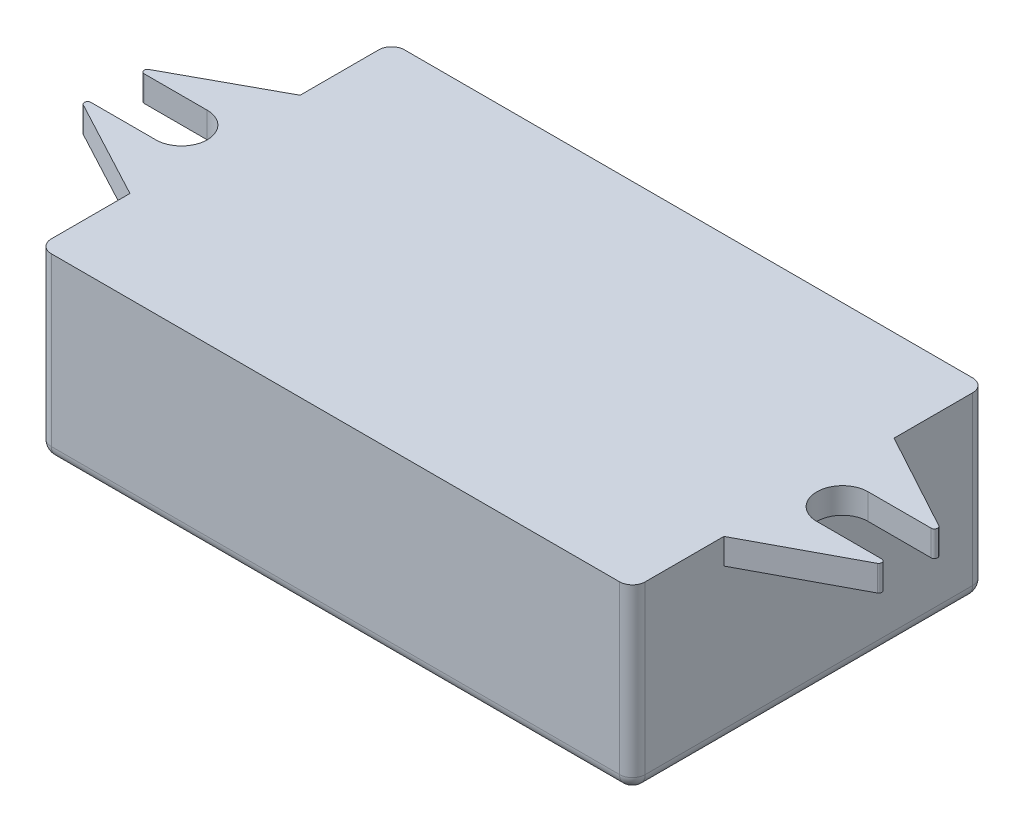
ISO-10303-21;
HEADER;
FILE_DESCRIPTION(('STEP AP214'),'2;1');
FILE_NAME('part.step','',(''),(''),'','','');
FILE_SCHEMA(('AUTOMOTIVE_DESIGN { 1 0 10303 214 1 1 1 1 }'));
ENDSEC;
DATA;
#1=APPLICATION_CONTEXT('core data for automotive mechanical design processes');
#2=APPLICATION_PROTOCOL_DEFINITION('international standard','automotive_design',2000,#1);
#3=PRODUCT_CONTEXT('',#1,'mechanical');
#4=PRODUCT('Part','Part','',(#3));
#5=PRODUCT_RELATED_PRODUCT_CATEGORY('part','',(#4));
#6=PRODUCT_DEFINITION_FORMATION('','',#4);
#7=PRODUCT_DEFINITION_CONTEXT('part definition',#1,'design');
#8=PRODUCT_DEFINITION('design','',#6,#7);
#9=PRODUCT_DEFINITION_SHAPE('','',#8);
#10=(LENGTH_UNIT() NAMED_UNIT(*) SI_UNIT(.MILLI.,.METRE.));
#11=(NAMED_UNIT(*) PLANE_ANGLE_UNIT() SI_UNIT($,.RADIAN.));
#12=(NAMED_UNIT(*) SI_UNIT($,.STERADIAN.) SOLID_ANGLE_UNIT());
#13=UNCERTAINTY_MEASURE_WITH_UNIT(LENGTH_MEASURE(1.E-05),#10,'distance_accuracy_value','');
#14=(GEOMETRIC_REPRESENTATION_CONTEXT(3) GLOBAL_UNCERTAINTY_ASSIGNED_CONTEXT((#13)) GLOBAL_UNIT_ASSIGNED_CONTEXT((#10,
#11,#12)) REPRESENTATION_CONTEXT('',''));
#15=CARTESIAN_POINT('',(0.,0.,0.));
#16=DIRECTION('',(0.,0.,1.));
#17=DIRECTION('',(1.,0.,0.));
#18=AXIS2_PLACEMENT_3D('',#15,#16,#17);
#19=CARTESIAN_POINT('',(35.6115448182948,0.,0.729525455250196));
#20=DIRECTION('',(0.,1.,0.));
#21=DIRECTION('',(0.,0.,1.));
#22=AXIS2_PLACEMENT_3D('',#19,#20,#21);
#23=PLANE('',#22);
#24=DIRECTION('',(1.,0.,0.));
#25=VECTOR('',#24,1.);
#26=CARTESIAN_POINT('',(-21.7468585785958,0.,-1.27047454474981));
#27=LINE('',#26,#25);
#28=CARTESIAN_POINT('',(-20.7643283831103,0.,-1.27047454474981));
#29=VERTEX_POINT('',#28);
#30=CARTESIAN_POINT('',(-15.8552619754863,0.,-1.27047454474981));
#31=VERTEX_POINT('',#30);
#32=EDGE_CURVE('E288',#29,#31,#27,.T.);
#33=ORIENTED_EDGE('',*,*,#32,.F.);
#34=CARTESIAN_POINT('',(-20.7643283831103,0.,-1.52047454474981));
#35=DIRECTION('',(0.,1.,0.));
#36=DIRECTION('',(0.,0.,1.));
#37=AXIS2_PLACEMENT_3D('',#34,#35,#36);
#38=CIRCLE('',#37,0.25);
#39=CARTESIAN_POINT('',(-20.8838150905389,0.,-1.74007173678075));
#40=VERTEX_POINT('',#39);
#41=EDGE_CURVE('E51',#29,#40,#38,.F.);
#42=ORIENTED_EDGE('',*,*,#41,.T.);
#43=DIRECTION('',(-0.878388768123751,0.,0.477946829714394));
#44=VECTOR('',#43,1.);
#45=CARTESIAN_POINT('',(-13.2468585785958,0.,-5.89547454474981));
#46=LINE('',#45,#44);
#47=CARTESIAN_POINT('',(-13.2468585785958,0.,-5.89547454474981));
#48=VERTEX_POINT('',#47);
#49=EDGE_CURVE('E290',#48,#40,#46,.T.);
#50=ORIENTED_EDGE('',*,*,#49,.F.);
#51=DIRECTION('',(0.,0.,-1.));
#52=VECTOR('',#51,1.);
#53=CARTESIAN_POINT('',(-13.2468585785958,0.,14.4795254552502));
#54=LINE('',#53,#52);
#55=CARTESIAN_POINT('',(-13.2468585785958,0.,7.3545254552502));
#56=VERTEX_POINT('',#55);
#57=EDGE_CURVE('E316',#56,#48,#54,.T.);
#58=ORIENTED_EDGE('',*,*,#57,.F.);
#59=DIRECTION('',(0.882297478750126,0.,0.470692212588195));
#60=VECTOR('',#59,1.);
#61=CARTESIAN_POINT('',(-21.9162729646575,0.,2.72952545525019));
#62=LINE('',#61,#60);
#63=CARTESIAN_POINT('',(-21.0341963786508,0.,3.20009982493772));
#64=VERTEX_POINT('',#63);
#65=EDGE_CURVE('E282',#64,#56,#62,.T.);
#66=ORIENTED_EDGE('',*,*,#65,.F.);
#67=CARTESIAN_POINT('',(-20.9165233255038,0.,2.97952545525019));
#68=DIRECTION('',(0.,1.,0.));
#69=DIRECTION('',(0.,0.,1.));
#70=AXIS2_PLACEMENT_3D('',#67,#68,#69);
#71=CIRCLE('',#70,0.25);
#72=CARTESIAN_POINT('',(-20.9165233255038,0.,2.72952545525019));
#73=VERTEX_POINT('',#72);
#74=EDGE_CURVE('E58',#64,#73,#71,.F.);
#75=ORIENTED_EDGE('',*,*,#74,.T.);
#76=DIRECTION('',(-1.,0.,0.));
#77=VECTOR('',#76,1.);
#78=CARTESIAN_POINT('',(-15.8552619754863,0.,2.7295254552502));
#79=LINE('',#78,#77);
#80=CARTESIAN_POINT('',(-15.8552619754863,0.,2.7295254552502));
#81=VERTEX_POINT('',#80);
#82=EDGE_CURVE('E284',#81,#73,#79,.T.);
#83=ORIENTED_EDGE('',*,*,#82,.F.);
#84=CARTESIAN_POINT('',(-15.8552619754863,0.,0.729525455250193));
#85=DIRECTION('',(0.,-1.,0.));
#86=DIRECTION('',(0.,0.,-1.));
#87=AXIS2_PLACEMENT_3D('',#84,#85,#86);
#88=CIRCLE('',#87,2.);
#89=EDGE_CURVE('E286',#31,#81,#88,.T.);
#90=ORIENTED_EDGE('',*,*,#89,.F.);
#91=EDGE_LOOP('',(#33,#42,#50,#58,#66,#75,#83,#90));
#92=FACE_BOUND('',#91,.T.);
#93=ADVANCED_FACE('F36',(#92),#23,.F.);
#94=DIRECTION('',(0.878388768123751,0.,0.477946829714394));
#95=VECTOR('',#94,1.);
#96=CARTESIAN_POINT('',(33.0031414214042,0.,-5.8954745447498));
#97=LINE('',#96,#95);
#98=CARTESIAN_POINT('',(33.0031414214042,0.,-5.8954745447498));
#99=VERTEX_POINT('',#98);
#100=CARTESIAN_POINT('',(40.6400979333473,0.,-1.74007173678074));
#101=VERTEX_POINT('',#100);
#102=EDGE_CURVE('E230',#99,#101,#97,.T.);
#103=ORIENTED_EDGE('',*,*,#102,.T.);
#104=CARTESIAN_POINT('',(40.5206112259188,0.,-1.5204745447498));
#105=DIRECTION('',(0.,1.,0.));
#106=DIRECTION('',(0.,0.,1.));
#107=AXIS2_PLACEMENT_3D('',#104,#105,#106);
#108=CIRCLE('',#107,0.25);
#109=CARTESIAN_POINT('',(40.5206112259188,0.,-1.2704745447498));
#110=VERTEX_POINT('',#109);
#111=EDGE_CURVE('E391',#101,#110,#108,.F.);
#112=ORIENTED_EDGE('',*,*,#111,.T.);
#113=DIRECTION('',(-1.,0.,0.));
#114=VECTOR('',#113,1.);
#115=CARTESIAN_POINT('',(41.5031414214042,0.,-1.2704745447498));
#116=LINE('',#115,#114);
#117=CARTESIAN_POINT('',(35.6115448182948,0.,-1.2704745447498));
#118=VERTEX_POINT('',#117);
#119=EDGE_CURVE('E271',#110,#118,#116,.T.);
#120=ORIENTED_EDGE('',*,*,#119,.T.);
#121=CARTESIAN_POINT('',(35.6115448182948,0.,0.729525455250196));
#122=DIRECTION('',(0.,1.,0.));
#123=DIRECTION('',(0.,0.,1.));
#124=AXIS2_PLACEMENT_3D('',#121,#122,#123);
#125=CIRCLE('',#124,2.);
#126=CARTESIAN_POINT('',(35.6115448182948,0.,2.7295254552502));
#127=VERTEX_POINT('',#126);
#128=EDGE_CURVE('E274',#118,#127,#125,.T.);
#129=ORIENTED_EDGE('',*,*,#128,.T.);
#130=DIRECTION('',(1.,0.,0.));
#131=VECTOR('',#130,1.);
#132=CARTESIAN_POINT('',(35.6115448182948,0.,2.7295254552502));
#133=LINE('',#132,#131);
#134=CARTESIAN_POINT('',(40.6728061683122,0.,2.7295254552502));
#135=VERTEX_POINT('',#134);
#136=EDGE_CURVE('E277',#127,#135,#133,.T.);
#137=ORIENTED_EDGE('',*,*,#136,.T.);
#138=CARTESIAN_POINT('',(40.6728061683122,0.,2.9795254552502));
#139=DIRECTION('',(0.,1.,0.));
#140=DIRECTION('',(0.,0.,1.));
#141=AXIS2_PLACEMENT_3D('',#138,#139,#140);
#142=CIRCLE('',#141,0.25);
#143=CARTESIAN_POINT('',(40.7904792214593,0.,3.20009982493773));
#144=VERTEX_POINT('',#143);
#145=EDGE_CURVE('E389',#135,#144,#142,.F.);
#146=ORIENTED_EDGE('',*,*,#145,.T.);
#147=DIRECTION('',(-0.882297478750126,0.,0.470692212588194));
#148=VECTOR('',#147,1.);
#149=CARTESIAN_POINT('',(41.672555807466,0.,2.7295254552502));
#150=LINE('',#149,#148);
#151=CARTESIAN_POINT('',(33.0031414214042,0.,7.3545254552502));
#152=VERTEX_POINT('',#151);
#153=EDGE_CURVE('E280',#144,#152,#150,.T.);
#154=ORIENTED_EDGE('',*,*,#153,.T.);
#155=DIRECTION('',(0.,0.,1.));
#156=VECTOR('',#155,1.);
#157=CARTESIAN_POINT('',(33.0031414214042,0.,14.4795254552502));
#158=LINE('',#157,#156);
#159=EDGE_CURVE('E295',#99,#152,#158,.T.);
#160=ORIENTED_EDGE('',*,*,#159,.F.);
#161=EDGE_LOOP('',(#103,#112,#120,#129,#137,#146,#154,#160));
#162=FACE_BOUND('',#161,.T.);
#163=ADVANCED_FACE('F472',(#162),#23,.F.);
#164=CARTESIAN_POINT('',(-13.2468585785958,2.,-5.89547454474981));
#165=DIRECTION('',(0.477946829714394,0.,0.878388768123751));
#166=DIRECTION('',(0.878388768123751,0.,-0.477946829714394));
#167=AXIS2_PLACEMENT_3D('',#164,#165,#166);
#168=PLANE('',#167);
#169=ORIENTED_EDGE('',*,*,#49,.T.);
#170=DIRECTION('',(0.,-1.,0.));
#171=VECTOR('',#170,1.);
#172=CARTESIAN_POINT('',(-20.8838150905389,2.,-1.74007173678075));
#173=LINE('',#172,#171);
#174=CARTESIAN_POINT('',(-20.8838150905389,2.,-1.74007173678075));
#175=VERTEX_POINT('',#174);
#176=EDGE_CURVE('E412',#40,#175,#173,.F.);
#177=ORIENTED_EDGE('',*,*,#176,.T.);
#178=DIRECTION('',(-0.878388768123751,0.,0.477946829714394));
#179=VECTOR('',#178,1.);
#180=CARTESIAN_POINT('',(-13.2468585785958,2.,-5.89547454474981));
#181=LINE('',#180,#179);
#182=CARTESIAN_POINT('',(-13.2468585785958,2.,-5.89547454474981));
#183=VERTEX_POINT('',#182);
#184=EDGE_CURVE('E232',#183,#175,#181,.T.);
#185=ORIENTED_EDGE('',*,*,#184,.F.);
#186=DIRECTION('',(0.,-1.,0.));
#187=VECTOR('',#186,1.);
#188=CARTESIAN_POINT('',(-13.2468585785958,2.,-5.89547454474981));
#189=LINE('',#188,#187);
#190=EDGE_CURVE('E293',#183,#48,#189,.T.);
#191=ORIENTED_EDGE('',*,*,#190,.T.);
#192=EDGE_LOOP('',(#169,#177,#185,#191));
#193=FACE_BOUND('',#192,.T.);
#194=ADVANCED_FACE('F546',(#193),#168,.F.);
#195=CARTESIAN_POINT('',(-21.7468585785958,2.,-1.27047454474981));
#196=DIRECTION('',(0.,0.,-1.));
#197=DIRECTION('',(-1.,0.,0.));
#198=AXIS2_PLACEMENT_3D('',#195,#196,#197);
#199=PLANE('',#198);
#200=DIRECTION('',(1.,0.,0.));
#201=VECTOR('',#200,1.);
#202=CARTESIAN_POINT('',(-21.7468585785958,2.,-1.27047454474981));
#203=LINE('',#202,#201);
#204=CARTESIAN_POINT('',(-20.7643283831103,2.,-1.27047454474981));
#205=VERTEX_POINT('',#204);
#206=CARTESIAN_POINT('',(-15.8552619754863,2.,-1.27047454474981));
#207=VERTEX_POINT('',#206);
#208=EDGE_CURVE('E266',#205,#207,#203,.T.);
#209=ORIENTED_EDGE('',*,*,#208,.F.);
#210=DIRECTION('',(0.,-1.,0.));
#211=VECTOR('',#210,1.);
#212=CARTESIAN_POINT('',(-20.7643283831103,2.,-1.27047454474981));
#213=LINE('',#212,#211);
#214=EDGE_CURVE('E407',#205,#29,#213,.T.);
#215=ORIENTED_EDGE('',*,*,#214,.T.);
#216=ORIENTED_EDGE('',*,*,#32,.T.);
#217=DIRECTION('',(0.,-1.,0.));
#218=VECTOR('',#217,1.);
#219=CARTESIAN_POINT('',(-15.8552619754863,2.,-1.27047454474981));
#220=LINE('',#219,#218);
#221=EDGE_CURVE('E296',#207,#31,#220,.T.);
#222=ORIENTED_EDGE('',*,*,#221,.F.);
#223=EDGE_LOOP('',(#209,#215,#216,#222));
#224=FACE_BOUND('',#223,.T.);
#225=ADVANCED_FACE('F526',(#224),#199,.F.);
#226=CARTESIAN_POINT('',(-15.8552619754863,2.,0.729525455250193));
#227=DIRECTION('',(0.,-1.,0.));
#228=DIRECTION('',(0.,0.,-1.));
#229=AXIS2_PLACEMENT_3D('',#226,#227,#228);
#230=CYLINDRICAL_SURFACE('',#229,2.);
#231=ORIENTED_EDGE('',*,*,#89,.T.);
#232=DIRECTION('',(0.,-1.,0.));
#233=VECTOR('',#232,1.);
#234=CARTESIAN_POINT('',(-15.8552619754863,2.,2.7295254552502));
#235=LINE('',#234,#233);
#236=CARTESIAN_POINT('',(-15.8552619754863,2.,2.7295254552502));
#237=VERTEX_POINT('',#236);
#238=EDGE_CURVE('E299',#237,#81,#235,.T.);
#239=ORIENTED_EDGE('',*,*,#238,.F.);
#240=CARTESIAN_POINT('',(-15.8552619754863,2.,0.729525455250193));
#241=DIRECTION('',(0.,-1.,0.));
#242=DIRECTION('',(0.,0.,-1.));
#243=AXIS2_PLACEMENT_3D('',#240,#241,#242);
#244=CIRCLE('',#243,2.);
#245=EDGE_CURVE('E264',#207,#237,#244,.T.);
#246=ORIENTED_EDGE('',*,*,#245,.F.);
#247=ORIENTED_EDGE('',*,*,#221,.T.);
#248=EDGE_LOOP('',(#231,#239,#246,#247));
#249=FACE_BOUND('',#248,.T.);
#250=ADVANCED_FACE('F531',(#249),#230,.F.);
#251=CARTESIAN_POINT('',(-15.8552619754863,2.,2.7295254552502));
#252=DIRECTION('',(0.,0.,1.));
#253=DIRECTION('',(1.,0.,0.));
#254=AXIS2_PLACEMENT_3D('',#251,#252,#253);
#255=PLANE('',#254);
#256=ORIENTED_EDGE('',*,*,#82,.T.);
#257=DIRECTION('',(0.,-1.,0.));
#258=VECTOR('',#257,1.);
#259=CARTESIAN_POINT('',(-20.9165233255038,2.,2.72952545525019));
#260=LINE('',#259,#258);
#261=CARTESIAN_POINT('',(-20.9165233255038,2.,2.72952545525019));
#262=VERTEX_POINT('',#261);
#263=EDGE_CURVE('E11',#73,#262,#260,.F.);
#264=ORIENTED_EDGE('',*,*,#263,.T.);
#265=DIRECTION('',(-1.,0.,0.));
#266=VECTOR('',#265,1.);
#267=CARTESIAN_POINT('',(-15.8552619754863,2.,2.7295254552502));
#268=LINE('',#267,#266);
#269=EDGE_CURVE('E261',#237,#262,#268,.T.);
#270=ORIENTED_EDGE('',*,*,#269,.F.);
#271=ORIENTED_EDGE('',*,*,#238,.T.);
#272=EDGE_LOOP('',(#256,#264,#270,#271));
#273=FACE_BOUND('',#272,.T.);
#274=ADVANCED_FACE('F535',(#273),#255,.F.);
#275=CARTESIAN_POINT('',(-21.9162729646575,2.,2.72952545525019));
#276=DIRECTION('',(0.470692212588195,0.,-0.882297478750126));
#277=DIRECTION('',(-0.882297478750126,0.,-0.470692212588195));
#278=AXIS2_PLACEMENT_3D('',#275,#276,#277);
#279=PLANE('',#278);
#280=DIRECTION('',(0.882297478750126,0.,0.470692212588195));
#281=VECTOR('',#280,1.);
#282=CARTESIAN_POINT('',(-21.9162729646575,2.,2.72952545525019));
#283=LINE('',#282,#281);
#284=CARTESIAN_POINT('',(-21.0341963786508,2.,3.20009982493772));
#285=VERTEX_POINT('',#284);
#286=CARTESIAN_POINT('',(-13.2468585785958,2.,7.3545254552502));
#287=VERTEX_POINT('',#286);
#288=EDGE_CURVE('E259',#285,#287,#283,.T.);
#289=ORIENTED_EDGE('',*,*,#288,.F.);
#290=DIRECTION('',(0.,-1.,0.));
#291=VECTOR('',#290,1.);
#292=CARTESIAN_POINT('',(-21.0341963786508,2.,3.20009982493772));
#293=LINE('',#292,#291);
#294=EDGE_CURVE('E44',#285,#64,#293,.T.);
#295=ORIENTED_EDGE('',*,*,#294,.T.);
#296=ORIENTED_EDGE('',*,*,#65,.T.);
#297=DIRECTION('',(0.,-1.,0.));
#298=VECTOR('',#297,1.);
#299=CARTESIAN_POINT('',(-13.2468585785958,2.,7.3545254552502));
#300=LINE('',#299,#298);
#301=EDGE_CURVE('E302',#287,#56,#300,.T.);
#302=ORIENTED_EDGE('',*,*,#301,.F.);
#303=EDGE_LOOP('',(#289,#295,#296,#302));
#304=FACE_BOUND('',#303,.T.);
#305=ADVANCED_FACE('F417',(#304),#279,.F.);
#306=CARTESIAN_POINT('',(-13.2468585785958,2.,14.4795254552502));
#307=DIRECTION('',(-1.,0.,0.));
#308=DIRECTION('',(0.,0.,1.));
#309=AXIS2_PLACEMENT_3D('',#306,#307,#308);
#310=PLANE('',#309);
#311=DIRECTION('',(0.,0.,-1.));
#312=VECTOR('',#311,1.);
#313=CARTESIAN_POINT('',(-13.2468585785958,-11.,14.4795254552502));
#314=LINE('',#313,#312);
#315=CARTESIAN_POINT('',(-13.2468585785958,-11.,-12.0204745447498));
#316=VERTEX_POINT('',#315);
#317=CARTESIAN_POINT('',(-13.2468585785958,-11.,13.4795254552502));
#318=VERTEX_POINT('',#317);
#319=EDGE_CURVE('E328',#316,#318,#314,.F.);
#320=ORIENTED_EDGE('',*,*,#319,.T.);
#321=DIRECTION('',(0.,-1.,0.));
#322=VECTOR('',#321,1.);
#323=CARTESIAN_POINT('',(-13.2468585785958,2.,13.4795254552502));
#324=LINE('',#323,#322);
#325=CARTESIAN_POINT('',(-13.2468585785958,2.,13.4795254552502));
#326=VERTEX_POINT('',#325);
#327=EDGE_CURVE('E332',#318,#326,#324,.F.);
#328=ORIENTED_EDGE('',*,*,#327,.T.);
#329=DIRECTION('',(0.,0.,-1.));
#330=VECTOR('',#329,1.);
#331=CARTESIAN_POINT('',(-13.2468585785958,2.,14.4795254552502));
#332=LINE('',#331,#330);
#333=EDGE_CURVE('E256',#326,#287,#332,.T.);
#334=ORIENTED_EDGE('',*,*,#333,.T.);
#335=ORIENTED_EDGE('',*,*,#301,.T.);
#336=ORIENTED_EDGE('',*,*,#57,.T.);
#337=ORIENTED_EDGE('',*,*,#190,.F.);
#338=DIRECTION('',(0.,0.,-1.));
#339=VECTOR('',#338,1.);
#340=CARTESIAN_POINT('',(-13.2468585785958,2.,-5.89547454474981));
#341=LINE('',#340,#339);
#342=CARTESIAN_POINT('',(-13.2468585785958,2.,-12.0204745447498));
#343=VERTEX_POINT('',#342);
#344=EDGE_CURVE('E292',#183,#343,#341,.T.);
#345=ORIENTED_EDGE('',*,*,#344,.T.);
#346=DIRECTION('',(0.,-1.,0.));
#347=VECTOR('',#346,1.);
#348=CARTESIAN_POINT('',(-13.2468585785958,2.,-12.0204745447498));
#349=LINE('',#348,#347);
#350=EDGE_CURVE('E330',#343,#316,#349,.T.);
#351=ORIENTED_EDGE('',*,*,#350,.T.);
#352=EDGE_LOOP('',(#320,#328,#334,#335,#336,#337,#345,#351));
#353=FACE_BOUND('',#352,.T.);
#354=ADVANCED_FACE('F425',(#353),#310,.T.);
#355=CARTESIAN_POINT('',(-13.2468585785958,2.,14.4795254552502));
#356=DIRECTION('',(0.,0.,-1.));
#357=DIRECTION('',(-1.,0.,0.));
#358=AXIS2_PLACEMENT_3D('',#355,#356,#357);
#359=PLANE('',#358);
#360=DIRECTION('',(1.,0.,0.));
#361=VECTOR('',#360,1.);
#362=CARTESIAN_POINT('',(-13.2468585785958,2.,14.4795254552502));
#363=LINE('',#362,#361);
#364=CARTESIAN_POINT('',(-12.2468585785958,2.,14.4795254552502));
#365=VERTEX_POINT('',#364);
#366=CARTESIAN_POINT('',(32.0031414214042,2.,14.4795254552502));
#367=VERTEX_POINT('',#366);
#368=EDGE_CURVE('E253',#365,#367,#363,.T.);
#369=ORIENTED_EDGE('',*,*,#368,.F.);
#370=DIRECTION('',(0.,-1.,0.));
#371=VECTOR('',#370,1.);
#372=CARTESIAN_POINT('',(-12.2468585785958,-11.,14.4795254552502));
#373=LINE('',#372,#371);
#374=CARTESIAN_POINT('',(-12.2468585785958,-11.,14.4795254552502));
#375=VERTEX_POINT('',#374);
#376=EDGE_CURVE('E326',#365,#375,#373,.T.);
#377=ORIENTED_EDGE('',*,*,#376,.T.);
#378=DIRECTION('',(-1.,0.,0.));
#379=VECTOR('',#378,1.);
#380=CARTESIAN_POINT('',(33.0031414214042,-11.,14.4795254552502));
#381=LINE('',#380,#379);
#382=CARTESIAN_POINT('',(32.0031414214042,-11.,14.4795254552502));
#383=VERTEX_POINT('',#382);
#384=EDGE_CURVE('E315',#375,#383,#381,.F.);
#385=ORIENTED_EDGE('',*,*,#384,.T.);
#386=DIRECTION('',(0.,-1.,0.));
#387=VECTOR('',#386,1.);
#388=CARTESIAN_POINT('',(32.0031414214042,2.,14.4795254552502));
#389=LINE('',#388,#387);
#390=EDGE_CURVE('E324',#383,#367,#389,.F.);
#391=ORIENTED_EDGE('',*,*,#390,.T.);
#392=EDGE_LOOP('',(#369,#377,#385,#391));
#393=FACE_BOUND('',#392,.T.);
#394=ADVANCED_FACE('F437',(#393),#359,.F.);
#395=CARTESIAN_POINT('',(33.0031414214042,2.,7.3545254552502));
#396=DIRECTION('',(1.,0.,0.));
#397=DIRECTION('',(0.,0.,-1.));
#398=AXIS2_PLACEMENT_3D('',#395,#396,#397);
#399=PLANE('',#398);
#400=DIRECTION('',(0.,0.,1.));
#401=VECTOR('',#400,1.);
#402=CARTESIAN_POINT('',(33.0031414214042,2.,7.3545254552502));
#403=LINE('',#402,#401);
#404=CARTESIAN_POINT('',(33.0031414214042,2.,7.3545254552502));
#405=VERTEX_POINT('',#404);
#406=CARTESIAN_POINT('',(33.0031414214042,2.,13.4795254552502));
#407=VERTEX_POINT('',#406);
#408=EDGE_CURVE('E251',#405,#407,#403,.T.);
#409=ORIENTED_EDGE('',*,*,#408,.T.);
#410=DIRECTION('',(0.,-1.,0.));
#411=VECTOR('',#410,1.);
#412=CARTESIAN_POINT('',(33.0031414214042,-11.,13.4795254552502));
#413=LINE('',#412,#411);
#414=CARTESIAN_POINT('',(33.0031414214042,-11.,13.4795254552502));
#415=VERTEX_POINT('',#414);
#416=EDGE_CURVE('E345',#407,#415,#413,.T.);
#417=ORIENTED_EDGE('',*,*,#416,.T.);
#418=DIRECTION('',(0.,0.,1.));
#419=VECTOR('',#418,1.);
#420=CARTESIAN_POINT('',(33.0031414214042,-11.,7.3545254552502));
#421=LINE('',#420,#419);
#422=CARTESIAN_POINT('',(33.0031414214042,-11.,-12.0204745447498));
#423=VERTEX_POINT('',#422);
#424=EDGE_CURVE('E342',#415,#423,#421,.F.);
#425=ORIENTED_EDGE('',*,*,#424,.T.);
#426=DIRECTION('',(0.,-1.,0.));
#427=VECTOR('',#426,1.);
#428=CARTESIAN_POINT('',(33.0031414214042,2.,-12.0204745447498));
#429=LINE('',#428,#427);
#430=CARTESIAN_POINT('',(33.0031414214042,2.,-12.0204745447498));
#431=VERTEX_POINT('',#430);
#432=EDGE_CURVE('E217',#423,#431,#429,.F.);
#433=ORIENTED_EDGE('',*,*,#432,.T.);
#434=DIRECTION('',(0.,0.,1.));
#435=VECTOR('',#434,1.);
#436=CARTESIAN_POINT('',(33.0031414214042,2.,-13.0204745447498));
#437=LINE('',#436,#435);
#438=CARTESIAN_POINT('',(33.0031414214042,2.,-5.8954745447498));
#439=VERTEX_POINT('',#438);
#440=EDGE_CURVE('E209',#431,#439,#437,.T.);
#441=ORIENTED_EDGE('',*,*,#440,.T.);
#442=DIRECTION('',(0.,-1.,0.));
#443=VECTOR('',#442,1.);
#444=CARTESIAN_POINT('',(33.0031414214042,2.,-5.8954745447498));
#445=LINE('',#444,#443);
#446=EDGE_CURVE('E214',#439,#99,#445,.T.);
#447=ORIENTED_EDGE('',*,*,#446,.T.);
#448=ORIENTED_EDGE('',*,*,#159,.T.);
#449=DIRECTION('',(0.,-1.,0.));
#450=VECTOR('',#449,1.);
#451=CARTESIAN_POINT('',(33.0031414214042,2.,7.3545254552502));
#452=LINE('',#451,#450);
#453=EDGE_CURVE('E305',#405,#152,#452,.T.);
#454=ORIENTED_EDGE('',*,*,#453,.F.);
#455=EDGE_LOOP('',(#409,#417,#425,#433,#441,#447,#448,#454));
#456=FACE_BOUND('',#455,.T.);
#457=ADVANCED_FACE('F212',(#456),#399,.T.);
#458=CARTESIAN_POINT('',(41.672555807466,2.,2.7295254552502));
#459=DIRECTION('',(0.470692212588194,0.,0.882297478750127));
#460=DIRECTION('',(0.882297478750127,0.,-0.470692212588194));
#461=AXIS2_PLACEMENT_3D('',#458,#459,#460);
#462=PLANE('',#461);
#463=ORIENTED_EDGE('',*,*,#153,.F.);
#464=DIRECTION('',(0.,-1.,0.));
#465=VECTOR('',#464,1.);
#466=CARTESIAN_POINT('',(40.7904792214593,2.,3.20009982493773));
#467=LINE('',#466,#465);
#468=CARTESIAN_POINT('',(40.7904792214593,2.,3.20009982493773));
#469=VERTEX_POINT('',#468);
#470=EDGE_CURVE('E405',#144,#469,#467,.F.);
#471=ORIENTED_EDGE('',*,*,#470,.T.);
#472=DIRECTION('',(-0.882297478750126,0.,0.470692212588194));
#473=VECTOR('',#472,1.);
#474=CARTESIAN_POINT('',(41.672555807466,2.,2.7295254552502));
#475=LINE('',#474,#473);
#476=EDGE_CURVE('E249',#469,#405,#475,.T.);
#477=ORIENTED_EDGE('',*,*,#476,.T.);
#478=ORIENTED_EDGE('',*,*,#453,.T.);
#479=EDGE_LOOP('',(#463,#471,#477,#478));
#480=FACE_BOUND('',#479,.T.);
#481=ADVANCED_FACE('F461',(#480),#462,.T.);
#482=CARTESIAN_POINT('',(35.6115448182948,2.,2.7295254552502));
#483=DIRECTION('',(0.,0.,-1.));
#484=DIRECTION('',(-1.,0.,0.));
#485=AXIS2_PLACEMENT_3D('',#482,#483,#484);
#486=PLANE('',#485);
#487=DIRECTION('',(1.,0.,0.));
#488=VECTOR('',#487,1.);
#489=CARTESIAN_POINT('',(35.6115448182948,2.,2.7295254552502));
#490=LINE('',#489,#488);
#491=CARTESIAN_POINT('',(35.6115448182948,2.,2.7295254552502));
#492=VERTEX_POINT('',#491);
#493=CARTESIAN_POINT('',(40.6728061683122,2.,2.7295254552502));
#494=VERTEX_POINT('',#493);
#495=EDGE_CURVE('E246',#492,#494,#490,.T.);
#496=ORIENTED_EDGE('',*,*,#495,.T.);
#497=DIRECTION('',(0.,-1.,0.));
#498=VECTOR('',#497,1.);
#499=CARTESIAN_POINT('',(40.6728061683122,2.,2.7295254552502));
#500=LINE('',#499,#498);
#501=EDGE_CURVE('E402',#494,#135,#500,.T.);
#502=ORIENTED_EDGE('',*,*,#501,.T.);
#503=ORIENTED_EDGE('',*,*,#136,.F.);
#504=DIRECTION('',(0.,-1.,0.));
#505=VECTOR('',#504,1.);
#506=CARTESIAN_POINT('',(35.6115448182948,2.,2.7295254552502));
#507=LINE('',#506,#505);
#508=EDGE_CURVE('E308',#492,#127,#507,.T.);
#509=ORIENTED_EDGE('',*,*,#508,.F.);
#510=EDGE_LOOP('',(#496,#502,#503,#509));
#511=FACE_BOUND('',#510,.T.);
#512=ADVANCED_FACE('F470',(#511),#486,.T.);
#513=CARTESIAN_POINT('',(35.6115448182948,2.,0.729525455250196));
#514=DIRECTION('',(0.,-1.,0.));
#515=DIRECTION('',(0.,0.,-1.));
#516=AXIS2_PLACEMENT_3D('',#513,#514,#515);
#517=CYLINDRICAL_SURFACE('',#516,2.);
#518=ORIENTED_EDGE('',*,*,#128,.F.);
#519=DIRECTION('',(0.,-1.,0.));
#520=VECTOR('',#519,1.);
#521=CARTESIAN_POINT('',(35.6115448182948,2.,-1.2704745447498));
#522=LINE('',#521,#520);
#523=CARTESIAN_POINT('',(35.6115448182948,2.,-1.2704745447498));
#524=VERTEX_POINT('',#523);
#525=EDGE_CURVE('E231',#524,#118,#522,.T.);
#526=ORIENTED_EDGE('',*,*,#525,.F.);
#527=CARTESIAN_POINT('',(35.6115448182948,2.,0.729525455250196));
#528=DIRECTION('',(0.,1.,0.));
#529=DIRECTION('',(0.,0.,1.));
#530=AXIS2_PLACEMENT_3D('',#527,#528,#529);
#531=CIRCLE('',#530,2.);
#532=EDGE_CURVE('E240',#524,#492,#531,.T.);
#533=ORIENTED_EDGE('',*,*,#532,.T.);
#534=ORIENTED_EDGE('',*,*,#508,.T.);
#535=EDGE_LOOP('',(#518,#526,#533,#534));
#536=FACE_BOUND('',#535,.T.);
#537=ADVANCED_FACE('F477',(#536),#517,.F.);
#538=CARTESIAN_POINT('',(41.5031414214042,2.,-1.2704745447498));
#539=DIRECTION('',(0.,0.,1.));
#540=DIRECTION('',(1.,0.,0.));
#541=AXIS2_PLACEMENT_3D('',#538,#539,#540);
#542=PLANE('',#541);
#543=ORIENTED_EDGE('',*,*,#119,.F.);
#544=DIRECTION('',(0.,-1.,0.));
#545=VECTOR('',#544,1.);
#546=CARTESIAN_POINT('',(40.5206112259188,2.,-1.2704745447498));
#547=LINE('',#546,#545);
#548=CARTESIAN_POINT('',(40.5206112259188,2.,-1.2704745447498));
#549=VERTEX_POINT('',#548);
#550=EDGE_CURVE('E393',#110,#549,#547,.F.);
#551=ORIENTED_EDGE('',*,*,#550,.T.);
#552=DIRECTION('',(-1.,0.,0.));
#553=VECTOR('',#552,1.);
#554=CARTESIAN_POINT('',(41.5031414214042,2.,-1.2704745447498));
#555=LINE('',#554,#553);
#556=EDGE_CURVE('E238',#549,#524,#555,.T.);
#557=ORIENTED_EDGE('',*,*,#556,.T.);
#558=ORIENTED_EDGE('',*,*,#525,.T.);
#559=EDGE_LOOP('',(#543,#551,#557,#558));
#560=FACE_BOUND('',#559,.T.);
#561=ADVANCED_FACE('F572',(#560),#542,.T.);
#562=CARTESIAN_POINT('',(33.0031414214042,2.,-5.8954745447498));
#563=DIRECTION('',(0.477946829714394,0.,-0.878388768123751));
#564=DIRECTION('',(-0.878388768123751,0.,-0.477946829714394));
#565=AXIS2_PLACEMENT_3D('',#562,#563,#564);
#566=PLANE('',#565);
#567=DIRECTION('',(0.878388768123751,0.,0.477946829714394));
#568=VECTOR('',#567,1.);
#569=CARTESIAN_POINT('',(33.0031414214042,2.,-5.8954745447498));
#570=LINE('',#569,#568);
#571=CARTESIAN_POINT('',(40.6400979333473,2.,-1.74007173678074));
#572=VERTEX_POINT('',#571);
#573=EDGE_CURVE('E221',#439,#572,#570,.T.);
#574=ORIENTED_EDGE('',*,*,#573,.T.);
#575=DIRECTION('',(0.,-1.,0.));
#576=VECTOR('',#575,1.);
#577=CARTESIAN_POINT('',(40.6400979333473,2.,-1.74007173678074));
#578=LINE('',#577,#576);
#579=EDGE_CURVE('E359',#572,#101,#578,.T.);
#580=ORIENTED_EDGE('',*,*,#579,.T.);
#581=ORIENTED_EDGE('',*,*,#102,.F.);
#582=ORIENTED_EDGE('',*,*,#446,.F.);
#583=EDGE_LOOP('',(#574,#580,#581,#582));
#584=FACE_BOUND('',#583,.T.);
#585=ADVANCED_FACE('F226',(#584),#566,.T.);
#586=CARTESIAN_POINT('',(-13.2468585785958,2.,-13.0204745447498));
#587=DIRECTION('',(0.,0.,-1.));
#588=DIRECTION('',(-1.,0.,0.));
#589=AXIS2_PLACEMENT_3D('',#586,#587,#588);
#590=PLANE('',#589);
#591=DIRECTION('',(1.,0.,0.));
#592=VECTOR('',#591,1.);
#593=CARTESIAN_POINT('',(-13.2468585785958,-11.,-13.0204745447498));
#594=LINE('',#593,#592);
#595=CARTESIAN_POINT('',(32.0031414214042,-11.,-13.0204745447498));
#596=VERTEX_POINT('',#595);
#597=CARTESIAN_POINT('',(-12.2468585785958,-11.,-13.0204745447498));
#598=VERTEX_POINT('',#597);
#599=EDGE_CURVE('E347',#596,#598,#594,.F.);
#600=ORIENTED_EDGE('',*,*,#599,.T.);
#601=DIRECTION('',(0.,-1.,0.));
#602=VECTOR('',#601,1.);
#603=CARTESIAN_POINT('',(-12.2468585785958,2.,-13.0204745447498));
#604=LINE('',#603,#602);
#605=CARTESIAN_POINT('',(-12.2468585785958,2.,-13.0204745447498));
#606=VERTEX_POINT('',#605);
#607=EDGE_CURVE('E351',#598,#606,#604,.F.);
#608=ORIENTED_EDGE('',*,*,#607,.T.);
#609=DIRECTION('',(1.,0.,0.));
#610=VECTOR('',#609,1.);
#611=CARTESIAN_POINT('',(-13.2468585785958,2.,-13.0204745447498));
#612=LINE('',#611,#610);
#613=CARTESIAN_POINT('',(32.0031414214042,2.,-13.0204745447498));
#614=VERTEX_POINT('',#613);
#615=EDGE_CURVE('E222',#606,#614,#612,.T.);
#616=ORIENTED_EDGE('',*,*,#615,.T.);
#617=DIRECTION('',(0.,-1.,0.));
#618=VECTOR('',#617,1.);
#619=CARTESIAN_POINT('',(32.0031414214042,2.,-13.0204745447498));
#620=LINE('',#619,#618);
#621=EDGE_CURVE('E349',#614,#596,#620,.T.);
#622=ORIENTED_EDGE('',*,*,#621,.T.);
#623=EDGE_LOOP('',(#600,#608,#616,#622));
#624=FACE_BOUND('',#623,.T.);
#625=ADVANCED_FACE('F490',(#624),#590,.T.);
#626=CARTESIAN_POINT('',(35.6115448182948,2.,0.729525455250196));
#627=DIRECTION('',(0.,1.,0.));
#628=DIRECTION('',(0.,0.,1.));
#629=AXIS2_PLACEMENT_3D('',#626,#627,#628);
#630=PLANE('',#629);
#631=ORIENTED_EDGE('',*,*,#556,.F.);
#632=CARTESIAN_POINT('',(40.5206112259188,2.,-1.5204745447498));
#633=DIRECTION('',(0.,1.,0.));
#634=DIRECTION('',(0.,0.,1.));
#635=AXIS2_PLACEMENT_3D('',#632,#633,#634);
#636=CIRCLE('',#635,0.25);
#637=EDGE_CURVE('E237',#549,#572,#636,.T.);
#638=ORIENTED_EDGE('',*,*,#637,.T.);
#639=ORIENTED_EDGE('',*,*,#573,.F.);
#640=ORIENTED_EDGE('',*,*,#440,.F.);
#641=CARTESIAN_POINT('',(32.0031414214042,2.,-12.0204745447498));
#642=DIRECTION('',(0.,1.,0.));
#643=DIRECTION('',(0.,0.,1.));
#644=AXIS2_PLACEMENT_3D('',#641,#642,#643);
#645=CIRCLE('',#644,1.);
#646=EDGE_CURVE('E334',#431,#614,#645,.T.);
#647=ORIENTED_EDGE('',*,*,#646,.T.);
#648=ORIENTED_EDGE('',*,*,#615,.F.);
#649=CARTESIAN_POINT('',(-12.2468585785958,2.,-12.0204745447498));
#650=DIRECTION('',(0.,1.,0.));
#651=DIRECTION('',(0.,0.,1.));
#652=AXIS2_PLACEMENT_3D('',#649,#650,#651);
#653=CIRCLE('',#652,1.);
#654=EDGE_CURVE('E336',#606,#343,#653,.T.);
#655=ORIENTED_EDGE('',*,*,#654,.T.);
#656=ORIENTED_EDGE('',*,*,#344,.F.);
#657=ORIENTED_EDGE('',*,*,#184,.T.);
#658=CARTESIAN_POINT('',(-20.7643283831103,2.,-1.52047454474981));
#659=DIRECTION('',(0.,1.,0.));
#660=DIRECTION('',(0.,0.,1.));
#661=AXIS2_PLACEMENT_3D('',#658,#659,#660);
#662=CIRCLE('',#661,0.25);
#663=EDGE_CURVE('E397',#175,#205,#662,.T.);
#664=ORIENTED_EDGE('',*,*,#663,.T.);
#665=ORIENTED_EDGE('',*,*,#208,.T.);
#666=ORIENTED_EDGE('',*,*,#245,.T.);
#667=ORIENTED_EDGE('',*,*,#269,.T.);
#668=CARTESIAN_POINT('',(-20.9165233255038,2.,2.97952545525019));
#669=DIRECTION('',(0.,1.,0.));
#670=DIRECTION('',(0.,0.,1.));
#671=AXIS2_PLACEMENT_3D('',#668,#669,#670);
#672=CIRCLE('',#671,0.25);
#673=EDGE_CURVE('E395',#262,#285,#672,.T.);
#674=ORIENTED_EDGE('',*,*,#673,.T.);
#675=ORIENTED_EDGE('',*,*,#288,.T.);
#676=ORIENTED_EDGE('',*,*,#333,.F.);
#677=CARTESIAN_POINT('',(-12.2468585785958,2.,13.4795254552502));
#678=DIRECTION('',(0.,1.,0.));
#679=DIRECTION('',(0.,0.,1.));
#680=AXIS2_PLACEMENT_3D('',#677,#678,#679);
#681=CIRCLE('',#680,1.);
#682=EDGE_CURVE('E340',#326,#365,#681,.T.);
#683=ORIENTED_EDGE('',*,*,#682,.T.);
#684=ORIENTED_EDGE('',*,*,#368,.T.);
#685=CARTESIAN_POINT('',(32.0031414214042,2.,13.4795254552502));
#686=DIRECTION('',(0.,1.,0.));
#687=DIRECTION('',(0.,0.,1.));
#688=AXIS2_PLACEMENT_3D('',#685,#686,#687);
#689=CIRCLE('',#688,1.);
#690=EDGE_CURVE('E338',#367,#407,#689,.T.);
#691=ORIENTED_EDGE('',*,*,#690,.T.);
#692=ORIENTED_EDGE('',*,*,#408,.F.);
#693=ORIENTED_EDGE('',*,*,#476,.F.);
#694=CARTESIAN_POINT('',(40.6728061683122,2.,2.9795254552502));
#695=DIRECTION('',(0.,1.,0.));
#696=DIRECTION('',(0.,0.,1.));
#697=AXIS2_PLACEMENT_3D('',#694,#695,#696);
#698=CIRCLE('',#697,0.25);
#699=EDGE_CURVE('E399',#469,#494,#698,.T.);
#700=ORIENTED_EDGE('',*,*,#699,.T.);
#701=ORIENTED_EDGE('',*,*,#495,.F.);
#702=ORIENTED_EDGE('',*,*,#532,.F.);
#703=EDGE_LOOP('',(#631,#638,#639,#640,#647,#648,#655,#656,#657,#664,#665,#666,#667,#674,#675,
#676,#683,#684,#691,#692,#693,#700,#701,#702));
#704=FACE_BOUND('',#703,.T.);
#705=ADVANCED_FACE('F235',(#704),#630,.T.);
#706=CARTESIAN_POINT('',(0.,-12.,0.));
#707=DIRECTION('',(0.,-1.,0.));
#708=DIRECTION('',(0.,0.,-1.));
#709=AXIS2_PLACEMENT_3D('',#706,#707,#708);
#710=PLANE('',#709);
#711=DIRECTION('',(1.,0.,0.));
#712=VECTOR('',#711,1.);
#713=CARTESIAN_POINT('',(0.,-12.,-12.0204745447498));
#714=LINE('',#713,#712);
#715=CARTESIAN_POINT('',(-12.2468585785958,-12.,-12.0204745447498));
#716=VERTEX_POINT('',#715);
#717=CARTESIAN_POINT('',(32.0031414214042,-12.,-12.0204745447498));
#718=VERTEX_POINT('',#717);
#719=EDGE_CURVE('E355',#716,#718,#714,.T.);
#720=ORIENTED_EDGE('',*,*,#719,.T.);
#721=DIRECTION('',(0.,0.,1.));
#722=VECTOR('',#721,1.);
#723=CARTESIAN_POINT('',(32.0031414214042,-12.,0.));
#724=LINE('',#723,#722);
#725=CARTESIAN_POINT('',(32.0031414214042,-12.,13.4795254552502));
#726=VERTEX_POINT('',#725);
#727=EDGE_CURVE('E357',#718,#726,#724,.T.);
#728=ORIENTED_EDGE('',*,*,#727,.T.);
#729=DIRECTION('',(-1.,0.,0.));
#730=VECTOR('',#729,1.);
#731=CARTESIAN_POINT('',(-13.2468585785958,-12.,13.4795254552502));
#732=LINE('',#731,#730);
#733=CARTESIAN_POINT('',(-12.2468585785958,-12.,13.4795254552502));
#734=VERTEX_POINT('',#733);
#735=EDGE_CURVE('E312',#726,#734,#732,.T.);
#736=ORIENTED_EDGE('',*,*,#735,.T.);
#737=DIRECTION('',(0.,0.,-1.));
#738=VECTOR('',#737,1.);
#739=CARTESIAN_POINT('',(-12.2468585785958,-12.,0.));
#740=LINE('',#739,#738);
#741=EDGE_CURVE('E353',#734,#716,#740,.T.);
#742=ORIENTED_EDGE('',*,*,#741,.T.);
#743=EDGE_LOOP('',(#720,#728,#736,#742));
#744=FACE_BOUND('',#743,.T.);
#745=ADVANCED_FACE('F581',(#744),#710,.T.);
#746=CARTESIAN_POINT('',(0.,-11.,13.4795254552502));
#747=DIRECTION('',(1.,0.,0.));
#748=DIRECTION('',(0.,0.,-1.));
#749=AXIS2_PLACEMENT_3D('',#746,#747,#748);
#750=CYLINDRICAL_SURFACE('',#749,1.);
#751=ORIENTED_EDGE('',*,*,#735,.F.);
#752=CARTESIAN_POINT('',(32.0031414214042,-11.,13.4795254552502));
#753=DIRECTION('',(1.,0.,0.));
#754=DIRECTION('',(0.,0.,-1.));
#755=AXIS2_PLACEMENT_3D('',#752,#753,#754);
#756=CIRCLE('',#755,1.);
#757=EDGE_CURVE('E321',#726,#383,#756,.F.);
#758=ORIENTED_EDGE('',*,*,#757,.T.);
#759=ORIENTED_EDGE('',*,*,#384,.F.);
#760=CARTESIAN_POINT('',(-12.2468585785958,-11.,13.4795254552502));
#761=DIRECTION('',(1.,0.,0.));
#762=DIRECTION('',(0.,0.,-1.));
#763=AXIS2_PLACEMENT_3D('',#760,#761,#762);
#764=CIRCLE('',#763,1.);
#765=EDGE_CURVE('E319',#375,#734,#764,.T.);
#766=ORIENTED_EDGE('',*,*,#765,.T.);
#767=EDGE_LOOP('',(#751,#758,#759,#766));
#768=FACE_BOUND('',#767,.T.);
#769=ADVANCED_FACE('F440',(#768),#750,.T.);
#770=CARTESIAN_POINT('',(-12.2468585785958,2.,13.4795254552502));
#771=DIRECTION('',(0.,1.,0.));
#772=DIRECTION('',(0.,0.,1.));
#773=AXIS2_PLACEMENT_3D('',#770,#771,#772);
#774=CYLINDRICAL_SURFACE('',#773,1.);
#775=CARTESIAN_POINT('',(-12.2468585785958,-11.,13.4795254552502));
#776=DIRECTION('',(0.,-1.,0.));
#777=DIRECTION('',(0.,0.,-1.));
#778=AXIS2_PLACEMENT_3D('',#775,#776,#777);
#779=CIRCLE('',#778,1.);
#780=EDGE_CURVE('E272',#375,#318,#779,.T.);
#781=ORIENTED_EDGE('',*,*,#780,.F.);
#782=ORIENTED_EDGE('',*,*,#376,.F.);
#783=ORIENTED_EDGE('',*,*,#682,.F.);
#784=ORIENTED_EDGE('',*,*,#327,.F.);
#785=EDGE_LOOP('',(#781,#782,#783,#784));
#786=FACE_BOUND('',#785,.T.);
#787=ADVANCED_FACE('F433',(#786),#774,.T.);
#788=CARTESIAN_POINT('',(-12.2468585785958,-11.,13.4795254552502));
#789=DIRECTION('',(-1.,0.,0.));
#790=DIRECTION('',(0.,0.,1.));
#791=AXIS2_PLACEMENT_3D('',#788,#789,#790);
#792=SPHERICAL_SURFACE('',#791,1.);
#793=ORIENTED_EDGE('',*,*,#765,.F.);
#794=ORIENTED_EDGE('',*,*,#780,.T.);
#795=CARTESIAN_POINT('',(-12.2468585785958,-11.,13.4795254552502));
#796=DIRECTION('',(0.,0.,-1.));
#797=DIRECTION('',(-1.,0.,0.));
#798=AXIS2_PLACEMENT_3D('',#795,#796,#797);
#799=CIRCLE('',#798,1.);
#800=EDGE_CURVE('E383',#734,#318,#799,.T.);
#801=ORIENTED_EDGE('',*,*,#800,.F.);
#802=EDGE_LOOP('',(#793,#794,#801));
#803=FACE_BOUND('',#802,.T.);
#804=ADVANCED_FACE('F600',(#803),#792,.T.);
#805=CARTESIAN_POINT('',(-12.2468585785958,2.,-12.0204745447498));
#806=DIRECTION('',(0.,-1.,0.));
#807=DIRECTION('',(0.,0.,-1.));
#808=AXIS2_PLACEMENT_3D('',#805,#806,#807);
#809=CYLINDRICAL_SURFACE('',#808,1.);
#810=ORIENTED_EDGE('',*,*,#654,.F.);
#811=ORIENTED_EDGE('',*,*,#607,.F.);
#812=CARTESIAN_POINT('',(-12.2468585785958,-11.,-12.0204745447498));
#813=DIRECTION('',(0.,-1.,0.));
#814=DIRECTION('',(0.,0.,-1.));
#815=AXIS2_PLACEMENT_3D('',#812,#813,#814);
#816=CIRCLE('',#815,1.);
#817=EDGE_CURVE('E380',#316,#598,#816,.T.);
#818=ORIENTED_EDGE('',*,*,#817,.F.);
#819=ORIENTED_EDGE('',*,*,#350,.F.);
#820=EDGE_LOOP('',(#810,#811,#818,#819));
#821=FACE_BOUND('',#820,.T.);
#822=ADVANCED_FACE('F506',(#821),#809,.T.);
#823=CARTESIAN_POINT('',(-12.2468585785958,-11.,0.));
#824=DIRECTION('',(0.,0.,-1.));
#825=DIRECTION('',(-1.,0.,0.));
#826=AXIS2_PLACEMENT_3D('',#823,#824,#825);
#827=CYLINDRICAL_SURFACE('',#826,1.);
#828=ORIENTED_EDGE('',*,*,#800,.T.);
#829=ORIENTED_EDGE('',*,*,#319,.F.);
#830=CARTESIAN_POINT('',(-12.2468585785958,-11.,-12.0204745447498));
#831=DIRECTION('',(0.,0.,-1.));
#832=DIRECTION('',(-1.,0.,0.));
#833=AXIS2_PLACEMENT_3D('',#830,#831,#832);
#834=CIRCLE('',#833,1.);
#835=EDGE_CURVE('E377',#716,#316,#834,.T.);
#836=ORIENTED_EDGE('',*,*,#835,.F.);
#837=ORIENTED_EDGE('',*,*,#741,.F.);
#838=EDGE_LOOP('',(#828,#829,#836,#837));
#839=FACE_BOUND('',#838,.T.);
#840=ADVANCED_FACE('F514',(#839),#827,.T.);
#841=CARTESIAN_POINT('',(-12.2468585785958,-11.,-12.0204745447498));
#842=DIRECTION('',(-1.,0.,0.));
#843=DIRECTION('',(0.,0.,1.));
#844=AXIS2_PLACEMENT_3D('',#841,#842,#843);
#845=SPHERICAL_SURFACE('',#844,1.);
#846=ORIENTED_EDGE('',*,*,#835,.T.);
#847=ORIENTED_EDGE('',*,*,#817,.T.);
#848=CARTESIAN_POINT('',(-12.2468585785958,-11.,-12.0204745447498));
#849=DIRECTION('',(-1.,0.,0.));
#850=DIRECTION('',(0.,0.,1.));
#851=AXIS2_PLACEMENT_3D('',#848,#849,#850);
#852=CIRCLE('',#851,1.);
#853=EDGE_CURVE('E374',#716,#598,#852,.F.);
#854=ORIENTED_EDGE('',*,*,#853,.F.);
#855=EDGE_LOOP('',(#846,#847,#854));
#856=FACE_BOUND('',#855,.T.);
#857=ADVANCED_FACE('F509',(#856),#845,.T.);
#858=CARTESIAN_POINT('',(32.0031414214042,2.,-12.0204745447498));
#859=DIRECTION('',(0.,-1.,0.));
#860=DIRECTION('',(0.,0.,-1.));
#861=AXIS2_PLACEMENT_3D('',#858,#859,#860);
#862=CYLINDRICAL_SURFACE('',#861,1.);
#863=ORIENTED_EDGE('',*,*,#646,.F.);
#864=ORIENTED_EDGE('',*,*,#432,.F.);
#865=CARTESIAN_POINT('',(32.0031414214042,-11.,-12.0204745447498));
#866=DIRECTION('',(0.,-1.,0.));
#867=DIRECTION('',(0.,0.,-1.));
#868=AXIS2_PLACEMENT_3D('',#865,#866,#867);
#869=CIRCLE('',#868,1.);
#870=EDGE_CURVE('E371',#596,#423,#869,.T.);
#871=ORIENTED_EDGE('',*,*,#870,.F.);
#872=ORIENTED_EDGE('',*,*,#621,.F.);
#873=EDGE_LOOP('',(#863,#864,#871,#872));
#874=FACE_BOUND('',#873,.T.);
#875=ADVANCED_FACE('F496',(#874),#862,.T.);
#876=CARTESIAN_POINT('',(0.,-11.,-12.0204745447498));
#877=DIRECTION('',(1.,0.,0.));
#878=DIRECTION('',(0.,0.,-1.));
#879=AXIS2_PLACEMENT_3D('',#876,#877,#878);
#880=CYLINDRICAL_SURFACE('',#879,1.);
#881=ORIENTED_EDGE('',*,*,#853,.T.);
#882=ORIENTED_EDGE('',*,*,#599,.F.);
#883=CARTESIAN_POINT('',(32.0031414214042,-11.,-12.0204745447498));
#884=DIRECTION('',(1.,0.,0.));
#885=DIRECTION('',(0.,0.,-1.));
#886=AXIS2_PLACEMENT_3D('',#883,#884,#885);
#887=CIRCLE('',#886,1.);
#888=EDGE_CURVE('E368',#718,#596,#887,.T.);
#889=ORIENTED_EDGE('',*,*,#888,.F.);
#890=ORIENTED_EDGE('',*,*,#719,.F.);
#891=EDGE_LOOP('',(#881,#882,#889,#890));
#892=FACE_BOUND('',#891,.T.);
#893=ADVANCED_FACE('F502',(#892),#880,.T.);
#894=CARTESIAN_POINT('',(32.0031414214042,-11.,-12.0204745447498));
#895=DIRECTION('',(0.,0.,-1.));
#896=DIRECTION('',(-1.,0.,0.));
#897=AXIS2_PLACEMENT_3D('',#894,#895,#896);
#898=SPHERICAL_SURFACE('',#897,1.);
#899=ORIENTED_EDGE('',*,*,#888,.T.);
#900=ORIENTED_EDGE('',*,*,#870,.T.);
#901=CARTESIAN_POINT('',(32.0031414214042,-11.,-12.0204745447498));
#902=DIRECTION('',(0.,0.,-1.));
#903=DIRECTION('',(-1.,0.,0.));
#904=AXIS2_PLACEMENT_3D('',#901,#902,#903);
#905=CIRCLE('',#904,1.);
#906=EDGE_CURVE('E365',#718,#423,#905,.F.);
#907=ORIENTED_EDGE('',*,*,#906,.F.);
#908=EDGE_LOOP('',(#899,#900,#907));
#909=FACE_BOUND('',#908,.T.);
#910=ADVANCED_FACE('F499',(#909),#898,.T.);
#911=CARTESIAN_POINT('',(32.0031414214042,2.,13.4795254552502));
#912=DIRECTION('',(0.,1.,0.));
#913=DIRECTION('',(0.,0.,1.));
#914=AXIS2_PLACEMENT_3D('',#911,#912,#913);
#915=CYLINDRICAL_SURFACE('',#914,1.);
#916=ORIENTED_EDGE('',*,*,#690,.F.);
#917=ORIENTED_EDGE('',*,*,#390,.F.);
#918=CARTESIAN_POINT('',(32.0031414214042,-11.,13.4795254552502));
#919=DIRECTION('',(0.,-1.,0.));
#920=DIRECTION('',(0.,0.,-1.));
#921=AXIS2_PLACEMENT_3D('',#918,#919,#920);
#922=CIRCLE('',#921,1.);
#923=EDGE_CURVE('E363',#415,#383,#922,.T.);
#924=ORIENTED_EDGE('',*,*,#923,.F.);
#925=ORIENTED_EDGE('',*,*,#416,.F.);
#926=EDGE_LOOP('',(#916,#917,#924,#925));
#927=FACE_BOUND('',#926,.T.);
#928=ADVANCED_FACE('F455',(#927),#915,.T.);
#929=CARTESIAN_POINT('',(32.0031414214042,-11.,0.));
#930=DIRECTION('',(0.,0.,1.));
#931=DIRECTION('',(1.,0.,0.));
#932=AXIS2_PLACEMENT_3D('',#929,#930,#931);
#933=CYLINDRICAL_SURFACE('',#932,1.);
#934=ORIENTED_EDGE('',*,*,#906,.T.);
#935=ORIENTED_EDGE('',*,*,#424,.F.);
#936=CARTESIAN_POINT('',(32.0031414214042,-11.,13.4795254552502));
#937=DIRECTION('',(0.,0.,1.));
#938=DIRECTION('',(1.,0.,0.));
#939=AXIS2_PLACEMENT_3D('',#936,#937,#938);
#940=CIRCLE('',#939,1.);
#941=EDGE_CURVE('E360',#726,#415,#940,.T.);
#942=ORIENTED_EDGE('',*,*,#941,.F.);
#943=ORIENTED_EDGE('',*,*,#727,.F.);
#944=EDGE_LOOP('',(#934,#935,#942,#943));
#945=FACE_BOUND('',#944,.T.);
#946=ADVANCED_FACE('F450',(#945),#933,.T.);
#947=CARTESIAN_POINT('',(32.0031414214042,-11.,13.4795254552502));
#948=DIRECTION('',(1.,0.,0.));
#949=DIRECTION('',(0.,0.,-1.));
#950=AXIS2_PLACEMENT_3D('',#947,#948,#949);
#951=SPHERICAL_SURFACE('',#950,1.);
#952=ORIENTED_EDGE('',*,*,#923,.T.);
#953=ORIENTED_EDGE('',*,*,#757,.F.);
#954=ORIENTED_EDGE('',*,*,#941,.T.);
#955=EDGE_LOOP('',(#952,#953,#954));
#956=FACE_BOUND('',#955,.T.);
#957=ADVANCED_FACE('F444',(#956),#951,.T.);
#958=CARTESIAN_POINT('',(40.5206112259188,2.,-1.5204745447498));
#959=DIRECTION('',(0.,-1.,0.));
#960=DIRECTION('',(0.,0.,-1.));
#961=AXIS2_PLACEMENT_3D('',#958,#959,#960);
#962=CYLINDRICAL_SURFACE('',#961,0.25);
#963=ORIENTED_EDGE('',*,*,#637,.F.);
#964=ORIENTED_EDGE('',*,*,#550,.F.);
#965=ORIENTED_EDGE('',*,*,#111,.F.);
#966=ORIENTED_EDGE('',*,*,#579,.F.);
#967=EDGE_LOOP('',(#963,#964,#965,#966));
#968=FACE_BOUND('',#967,.T.);
#969=ADVANCED_FACE('F482',(#968),#962,.T.);
#970=CARTESIAN_POINT('',(40.6728061683122,2.,2.9795254552502));
#971=DIRECTION('',(0.,-1.,0.));
#972=DIRECTION('',(0.,0.,-1.));
#973=AXIS2_PLACEMENT_3D('',#970,#971,#972);
#974=CYLINDRICAL_SURFACE('',#973,0.25);
#975=ORIENTED_EDGE('',*,*,#699,.F.);
#976=ORIENTED_EDGE('',*,*,#470,.F.);
#977=ORIENTED_EDGE('',*,*,#145,.F.);
#978=ORIENTED_EDGE('',*,*,#501,.F.);
#979=EDGE_LOOP('',(#975,#976,#977,#978));
#980=FACE_BOUND('',#979,.T.);
#981=ADVANCED_FACE('F467',(#980),#974,.T.);
#982=CARTESIAN_POINT('',(-20.7643283831103,2.,-1.52047454474981));
#983=DIRECTION('',(0.,-1.,0.));
#984=DIRECTION('',(0.,0.,-1.));
#985=AXIS2_PLACEMENT_3D('',#982,#983,#984);
#986=CYLINDRICAL_SURFACE('',#985,0.25);
#987=ORIENTED_EDGE('',*,*,#663,.F.);
#988=ORIENTED_EDGE('',*,*,#176,.F.);
#989=ORIENTED_EDGE('',*,*,#41,.F.);
#990=ORIENTED_EDGE('',*,*,#214,.F.);
#991=EDGE_LOOP('',(#987,#988,#989,#990));
#992=FACE_BOUND('',#991,.T.);
#993=ADVANCED_FACE('F524',(#992),#986,.T.);
#994=CARTESIAN_POINT('',(-20.9165233255038,2.,2.97952545525019));
#995=DIRECTION('',(0.,-1.,0.));
#996=DIRECTION('',(0.,0.,-1.));
#997=AXIS2_PLACEMENT_3D('',#994,#995,#996);
#998=CYLINDRICAL_SURFACE('',#997,0.25);
#999=ORIENTED_EDGE('',*,*,#673,.F.);
#1000=ORIENTED_EDGE('',*,*,#263,.F.);
#1001=ORIENTED_EDGE('',*,*,#74,.F.);
#1002=ORIENTED_EDGE('',*,*,#294,.F.);
#1003=EDGE_LOOP('',(#999,#1000,#1001,#1002));
#1004=FACE_BOUND('',#1003,.T.);
#1005=ADVANCED_FACE('F38',(#1004),#998,.T.);
#1006=CLOSED_SHELL('',(#93,#163,#194,#225,#250,#274,#305,#354,#394,#457,#481,#512,#537,#561,
#585,#625,#705,#745,#769,#787,#804,#822,#840,#857,#875,#893,#910,#928,#946,#957,#969,#981,#993,#1005));
#1007=MANIFOLD_SOLID_BREP('B2',#1006);
#1008=ADVANCED_BREP_SHAPE_REPRESENTATION('',(#18,#1007),#14);
#1009=SHAPE_DEFINITION_REPRESENTATION(#9,#1008);
ENDSEC;
END-ISO-10303-21;
